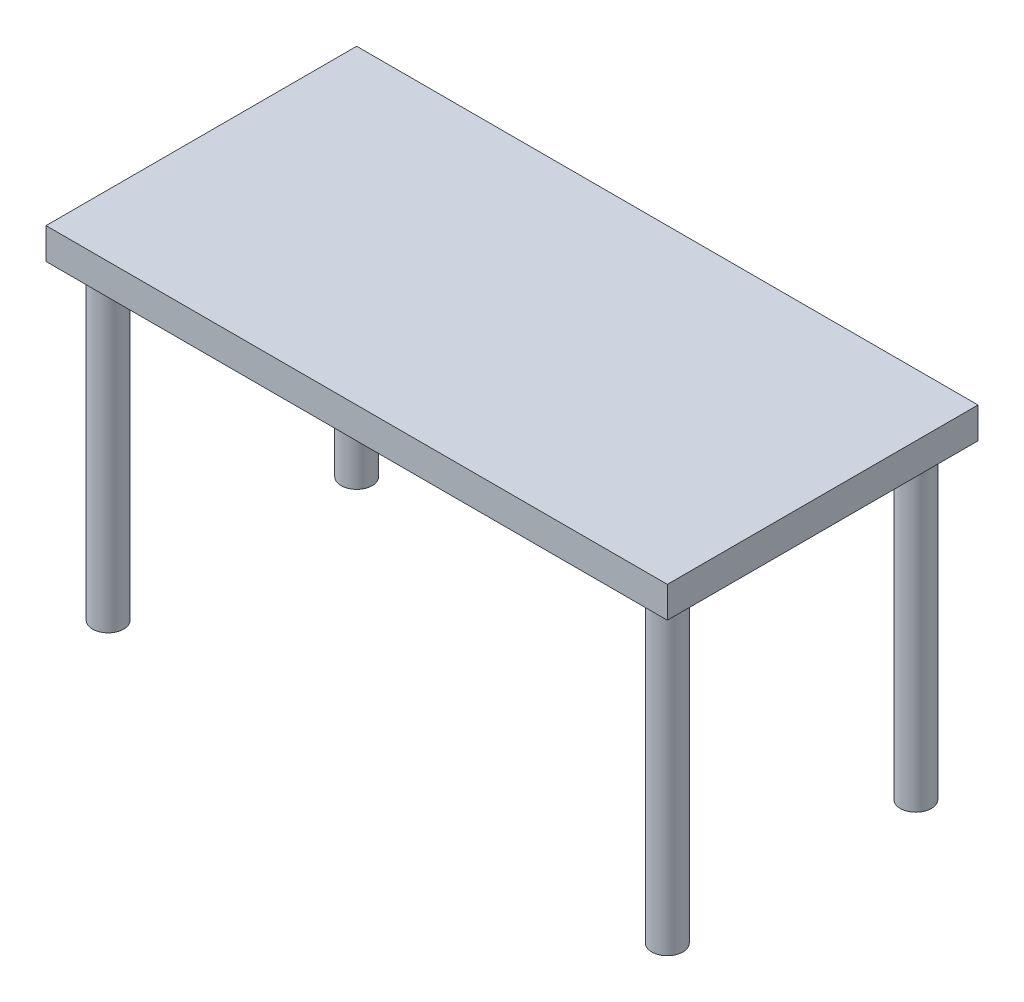
ISO-10303-21;
HEADER;
FILE_DESCRIPTION(('STEP AP214'),'2;1');
FILE_NAME('part.step','',(''),(''),'','','');
FILE_SCHEMA(('AUTOMOTIVE_DESIGN { 1 0 10303 214 1 1 1 1 }'));
ENDSEC;
DATA;
#1=APPLICATION_CONTEXT('core data for automotive mechanical design processes');
#2=APPLICATION_PROTOCOL_DEFINITION('international standard','automotive_design',2000,#1);
#3=PRODUCT_CONTEXT('',#1,'mechanical');
#4=PRODUCT('Part','Part','',(#3));
#5=PRODUCT_RELATED_PRODUCT_CATEGORY('part','',(#4));
#6=PRODUCT_DEFINITION_FORMATION('','',#4);
#7=PRODUCT_DEFINITION_CONTEXT('part definition',#1,'design');
#8=PRODUCT_DEFINITION('design','',#6,#7);
#9=PRODUCT_DEFINITION_SHAPE('','',#8);
#10=(LENGTH_UNIT() NAMED_UNIT(*) SI_UNIT(.MILLI.,.METRE.));
#11=(NAMED_UNIT(*) PLANE_ANGLE_UNIT() SI_UNIT($,.RADIAN.));
#12=(NAMED_UNIT(*) SI_UNIT($,.STERADIAN.) SOLID_ANGLE_UNIT());
#13=UNCERTAINTY_MEASURE_WITH_UNIT(LENGTH_MEASURE(1.E-05),#10,'distance_accuracy_value','');
#14=(GEOMETRIC_REPRESENTATION_CONTEXT(3) GLOBAL_UNCERTAINTY_ASSIGNED_CONTEXT((#13)) GLOBAL_UNIT_ASSIGNED_CONTEXT((#10,
#11,#12)) REPRESENTATION_CONTEXT('',''));
#15=CARTESIAN_POINT('',(0.,0.,0.));
#16=DIRECTION('',(0.,0.,1.));
#17=DIRECTION('',(1.,0.,0.));
#18=AXIS2_PLACEMENT_3D('',#15,#16,#17);
#19=CARTESIAN_POINT('',(0.,-100.,-500.));
#20=DIRECTION('',(0.,0.,-1.));
#21=DIRECTION('',(-1.,0.,0.));
#22=AXIS2_PLACEMENT_3D('',#19,#20,#21);
#23=PLANE('',#22);
#24=DIRECTION('',(-1.,0.,0.));
#25=VECTOR('',#24,1.);
#26=CARTESIAN_POINT('',(0.,0.,-500.));
#27=LINE('',#26,#25);
#28=CARTESIAN_POINT('',(1000.,0.,-500.));
#29=VERTEX_POINT('',#28);
#30=CARTESIAN_POINT('',(-1000.,0.,-500.));
#31=VERTEX_POINT('',#30);
#32=EDGE_CURVE('E122',#29,#31,#27,.T.);
#33=ORIENTED_EDGE('',*,*,#32,.F.);
#34=DIRECTION('',(0.,1.,0.));
#35=VECTOR('',#34,1.);
#36=CARTESIAN_POINT('',(1000.,-100.,-500.));
#37=LINE('',#36,#35);
#38=CARTESIAN_POINT('',(1000.,-100.,-500.));
#39=VERTEX_POINT('',#38);
#40=EDGE_CURVE('E48',#39,#29,#37,.T.);
#41=ORIENTED_EDGE('',*,*,#40,.F.);
#42=DIRECTION('',(-1.,0.,0.));
#43=VECTOR('',#42,1.);
#44=CARTESIAN_POINT('',(0.,-100.,-500.));
#45=LINE('',#44,#43);
#46=CARTESIAN_POINT('',(-1000.,-100.,-500.));
#47=VERTEX_POINT('',#46);
#48=EDGE_CURVE('E121',#39,#47,#45,.T.);
#49=ORIENTED_EDGE('',*,*,#48,.T.);
#50=DIRECTION('',(0.,1.,0.));
#51=VECTOR('',#50,1.);
#52=CARTESIAN_POINT('',(-1000.,-100.,-500.));
#53=LINE('',#52,#51);
#54=EDGE_CURVE('E78',#47,#31,#53,.T.);
#55=ORIENTED_EDGE('',*,*,#54,.T.);
#56=EDGE_LOOP('',(#33,#41,#49,#55));
#57=FACE_BOUND('',#56,.T.);
#58=ADVANCED_FACE('F33',(#57),#23,.T.);
#59=CARTESIAN_POINT('',(1000.,-100.,0.));
#60=DIRECTION('',(1.,0.,0.));
#61=DIRECTION('',(0.,0.,-1.));
#62=AXIS2_PLACEMENT_3D('',#59,#60,#61);
#63=PLANE('',#62);
#64=DIRECTION('',(0.,0.,-1.));
#65=VECTOR('',#64,1.);
#66=CARTESIAN_POINT('',(1000.,0.,0.));
#67=LINE('',#66,#65);
#68=CARTESIAN_POINT('',(1000.,0.,500.));
#69=VERTEX_POINT('',#68);
#70=EDGE_CURVE('E117',#69,#29,#67,.T.);
#71=ORIENTED_EDGE('',*,*,#70,.F.);
#72=DIRECTION('',(0.,1.,0.));
#73=VECTOR('',#72,1.);
#74=CARTESIAN_POINT('',(1000.,-100.,500.));
#75=LINE('',#74,#73);
#76=CARTESIAN_POINT('',(1000.,-100.,500.));
#77=VERTEX_POINT('',#76);
#78=EDGE_CURVE('E90',#77,#69,#75,.T.);
#79=ORIENTED_EDGE('',*,*,#78,.F.);
#80=DIRECTION('',(0.,0.,-1.));
#81=VECTOR('',#80,1.);
#82=CARTESIAN_POINT('',(1000.,-100.,0.));
#83=LINE('',#82,#81);
#84=EDGE_CURVE('E86',#77,#39,#83,.T.);
#85=ORIENTED_EDGE('',*,*,#84,.T.);
#86=ORIENTED_EDGE('',*,*,#40,.T.);
#87=EDGE_LOOP('',(#71,#79,#85,#86));
#88=FACE_BOUND('',#87,.T.);
#89=ADVANCED_FACE('F35',(#88),#63,.T.);
#90=CARTESIAN_POINT('',(0.,-100.,0.));
#91=DIRECTION('',(0.,-1.,0.));
#92=DIRECTION('',(0.,0.,-1.));
#93=AXIS2_PLACEMENT_3D('',#90,#91,#92);
#94=PLANE('',#93);
#95=CARTESIAN_POINT('',(-900.,-100.,400.));
#96=DIRECTION('',(0.,-1.,0.));
#97=DIRECTION('',(0.,0.,1.));
#98=AXIS2_PLACEMENT_3D('',#95,#96,#97);
#99=CIRCLE('',#98,50.);
#100=CARTESIAN_POINT('',(-900.,-100.,450.));
#101=VERTEX_POINT('',#100);
#102=EDGE_CURVE('E102',#101,#101,#99,.T.);
#103=ORIENTED_EDGE('',*,*,#102,.F.);
#104=EDGE_LOOP('',(#103));
#105=FACE_BOUND('',#104,.T.);
#106=CARTESIAN_POINT('',(900.,-100.,400.));
#107=DIRECTION('',(0.,-1.,0.));
#108=DIRECTION('',(0.,0.,-1.));
#109=AXIS2_PLACEMENT_3D('',#106,#107,#108);
#110=CIRCLE('',#109,50.);
#111=CARTESIAN_POINT('',(900.,-100.,350.));
#112=VERTEX_POINT('',#111);
#113=EDGE_CURVE('E11',#112,#112,#110,.T.);
#114=ORIENTED_EDGE('',*,*,#113,.F.);
#115=EDGE_LOOP('',(#114));
#116=FACE_BOUND('',#115,.T.);
#117=CARTESIAN_POINT('',(-900.,-100.,-400.));
#118=DIRECTION('',(0.,-1.,0.));
#119=DIRECTION('',(0.,0.,-1.));
#120=AXIS2_PLACEMENT_3D('',#117,#118,#119);
#121=CIRCLE('',#120,50.);
#122=CARTESIAN_POINT('',(-900.,-100.,-450.));
#123=VERTEX_POINT('',#122);
#124=EDGE_CURVE('E42',#123,#123,#121,.T.);
#125=ORIENTED_EDGE('',*,*,#124,.F.);
#126=EDGE_LOOP('',(#125));
#127=FACE_BOUND('',#126,.T.);
#128=CARTESIAN_POINT('',(900.,-100.,-400.));
#129=DIRECTION('',(0.,-1.,0.));
#130=DIRECTION('',(0.,0.,-1.));
#131=AXIS2_PLACEMENT_3D('',#128,#129,#130);
#132=CIRCLE('',#131,50.);
#133=CARTESIAN_POINT('',(900.,-100.,-450.));
#134=VERTEX_POINT('',#133);
#135=EDGE_CURVE('E113',#134,#134,#132,.T.);
#136=ORIENTED_EDGE('',*,*,#135,.F.);
#137=EDGE_LOOP('',(#136));
#138=FACE_BOUND('',#137,.T.);
#139=DIRECTION('',(-1.,0.,0.));
#140=VECTOR('',#139,1.);
#141=CARTESIAN_POINT('',(0.,-100.,500.));
#142=LINE('',#141,#140);
#143=CARTESIAN_POINT('',(-1000.,-100.,500.));
#144=VERTEX_POINT('',#143);
#145=EDGE_CURVE('E84',#77,#144,#142,.T.);
#146=ORIENTED_EDGE('',*,*,#145,.T.);
#147=DIRECTION('',(0.,0.,-1.));
#148=VECTOR('',#147,1.);
#149=CARTESIAN_POINT('',(-1000.,-100.,0.));
#150=LINE('',#149,#148);
#151=EDGE_CURVE('E71',#144,#47,#150,.T.);
#152=ORIENTED_EDGE('',*,*,#151,.T.);
#153=ORIENTED_EDGE('',*,*,#48,.F.);
#154=ORIENTED_EDGE('',*,*,#84,.F.);
#155=EDGE_LOOP('',(#146,#152,#153,#154));
#156=FACE_BOUND('',#155,.T.);
#157=ADVANCED_FACE('F85',(#105,#116,#127,#138,#156),#94,.T.);
#158=CARTESIAN_POINT('',(0.,0.,0.));
#159=DIRECTION('',(0.,-1.,0.));
#160=DIRECTION('',(0.,0.,-1.));
#161=AXIS2_PLACEMENT_3D('',#158,#159,#160);
#162=PLANE('',#161);
#163=ORIENTED_EDGE('',*,*,#32,.T.);
#164=DIRECTION('',(0.,0.,-1.));
#165=VECTOR('',#164,1.);
#166=CARTESIAN_POINT('',(-1000.,0.,0.));
#167=LINE('',#166,#165);
#168=CARTESIAN_POINT('',(-1000.,0.,500.));
#169=VERTEX_POINT('',#168);
#170=EDGE_CURVE('E81',#169,#31,#167,.T.);
#171=ORIENTED_EDGE('',*,*,#170,.F.);
#172=DIRECTION('',(-1.,0.,0.));
#173=VECTOR('',#172,1.);
#174=CARTESIAN_POINT('',(0.,0.,500.));
#175=LINE('',#174,#173);
#176=EDGE_CURVE('E91',#69,#169,#175,.T.);
#177=ORIENTED_EDGE('',*,*,#176,.F.);
#178=ORIENTED_EDGE('',*,*,#70,.T.);
#179=EDGE_LOOP('',(#163,#171,#177,#178));
#180=FACE_BOUND('',#179,.T.);
#181=ADVANCED_FACE('F134',(#180),#162,.F.);
#182=CARTESIAN_POINT('',(900.,-1100.,-400.));
#183=DIRECTION('',(0.,1.,0.));
#184=DIRECTION('',(0.,0.,1.));
#185=AXIS2_PLACEMENT_3D('',#182,#183,#184);
#186=CYLINDRICAL_SURFACE('',#185,50.);
#187=CARTESIAN_POINT('',(900.,-1100.,-400.));
#188=DIRECTION('',(0.,-1.,0.));
#189=DIRECTION('',(0.,0.,-1.));
#190=AXIS2_PLACEMENT_3D('',#187,#188,#189);
#191=CIRCLE('',#190,50.);
#192=CARTESIAN_POINT('',(900.,-1100.,-450.));
#193=VERTEX_POINT('',#192);
#194=EDGE_CURVE('E114',#193,#193,#191,.T.);
#195=ORIENTED_EDGE('',*,*,#194,.F.);
#196=EDGE_LOOP('',(#195));
#197=FACE_BOUND('',#196,.T.);
#198=ORIENTED_EDGE('',*,*,#135,.T.);
#199=EDGE_LOOP('',(#198));
#200=FACE_BOUND('',#199,.T.);
#201=ADVANCED_FACE('F139',(#197,#200),#186,.T.);
#202=CARTESIAN_POINT('',(900.,-1100.,-400.));
#203=DIRECTION('',(0.,-1.,0.));
#204=DIRECTION('',(0.,0.,-1.));
#205=AXIS2_PLACEMENT_3D('',#202,#203,#204);
#206=PLANE('',#205);
#207=ORIENTED_EDGE('',*,*,#194,.T.);
#208=EDGE_LOOP('',(#207));
#209=FACE_BOUND('',#208,.T.);
#210=ADVANCED_FACE('F141',(#209),#206,.T.);
#211=CARTESIAN_POINT('',(-1000.,-100.,0.));
#212=DIRECTION('',(1.,0.,0.));
#213=DIRECTION('',(0.,0.,-1.));
#214=AXIS2_PLACEMENT_3D('',#211,#212,#213);
#215=PLANE('',#214);
#216=ORIENTED_EDGE('',*,*,#170,.T.);
#217=ORIENTED_EDGE('',*,*,#54,.F.);
#218=ORIENTED_EDGE('',*,*,#151,.F.);
#219=DIRECTION('',(0.,1.,0.));
#220=VECTOR('',#219,1.);
#221=CARTESIAN_POINT('',(-1000.,-100.,500.));
#222=LINE('',#221,#220);
#223=EDGE_CURVE('E76',#144,#169,#222,.T.);
#224=ORIENTED_EDGE('',*,*,#223,.T.);
#225=EDGE_LOOP('',(#216,#217,#218,#224));
#226=FACE_BOUND('',#225,.T.);
#227=ADVANCED_FACE('F74',(#226),#215,.F.);
#228=CARTESIAN_POINT('',(-900.,-1100.,-400.));
#229=DIRECTION('',(0.,1.,0.));
#230=DIRECTION('',(0.,0.,1.));
#231=AXIS2_PLACEMENT_3D('',#228,#229,#230);
#232=CYLINDRICAL_SURFACE('',#231,50.);
#233=CARTESIAN_POINT('',(-900.,-1100.,-400.));
#234=DIRECTION('',(0.,1.,0.));
#235=DIRECTION('',(0.,0.,-1.));
#236=AXIS2_PLACEMENT_3D('',#233,#234,#235);
#237=CIRCLE('',#236,50.);
#238=CARTESIAN_POINT('',(-900.,-1100.,-450.));
#239=VERTEX_POINT('',#238);
#240=EDGE_CURVE('E108',#239,#239,#237,.T.);
#241=ORIENTED_EDGE('',*,*,#240,.T.);
#242=EDGE_LOOP('',(#241));
#243=FACE_BOUND('',#242,.T.);
#244=ORIENTED_EDGE('',*,*,#124,.T.);
#245=EDGE_LOOP('',(#244));
#246=FACE_BOUND('',#245,.T.);
#247=ADVANCED_FACE('F130',(#243,#246),#232,.T.);
#248=CARTESIAN_POINT('',(-900.,-1100.,-400.));
#249=DIRECTION('',(0.,-1.,0.));
#250=DIRECTION('',(0.,0.,-1.));
#251=AXIS2_PLACEMENT_3D('',#248,#249,#250);
#252=PLANE('',#251);
#253=ORIENTED_EDGE('',*,*,#240,.F.);
#254=EDGE_LOOP('',(#253));
#255=FACE_BOUND('',#254,.T.);
#256=ADVANCED_FACE('F190',(#255),#252,.T.);
#257=CARTESIAN_POINT('',(0.,-100.,500.));
#258=DIRECTION('',(0.,0.,-1.));
#259=DIRECTION('',(-1.,0.,0.));
#260=AXIS2_PLACEMENT_3D('',#257,#258,#259);
#261=PLANE('',#260);
#262=ORIENTED_EDGE('',*,*,#176,.T.);
#263=ORIENTED_EDGE('',*,*,#223,.F.);
#264=ORIENTED_EDGE('',*,*,#145,.F.);
#265=ORIENTED_EDGE('',*,*,#78,.T.);
#266=EDGE_LOOP('',(#262,#263,#264,#265));
#267=FACE_BOUND('',#266,.T.);
#268=ADVANCED_FACE('F94',(#267),#261,.F.);
#269=CARTESIAN_POINT('',(900.,-1100.,400.));
#270=DIRECTION('',(0.,1.,0.));
#271=DIRECTION('',(0.,0.,1.));
#272=AXIS2_PLACEMENT_3D('',#269,#270,#271);
#273=CYLINDRICAL_SURFACE('',#272,50.);
#274=CARTESIAN_POINT('',(900.,-1100.,400.));
#275=DIRECTION('',(0.,1.,0.));
#276=DIRECTION('',(0.,0.,1.));
#277=AXIS2_PLACEMENT_3D('',#274,#275,#276);
#278=CIRCLE('',#277,50.);
#279=CARTESIAN_POINT('',(900.,-1100.,450.));
#280=VERTEX_POINT('',#279);
#281=EDGE_CURVE('E96',#280,#280,#278,.T.);
#282=ORIENTED_EDGE('',*,*,#281,.T.);
#283=EDGE_LOOP('',(#282));
#284=FACE_BOUND('',#283,.T.);
#285=ORIENTED_EDGE('',*,*,#113,.T.);
#286=EDGE_LOOP('',(#285));
#287=FACE_BOUND('',#286,.T.);
#288=ADVANCED_FACE('F189',(#284,#287),#273,.T.);
#289=CARTESIAN_POINT('',(900.,-1100.,400.));
#290=DIRECTION('',(0.,-1.,0.));
#291=DIRECTION('',(0.,0.,1.));
#292=AXIS2_PLACEMENT_3D('',#289,#290,#291);
#293=PLANE('',#292);
#294=ORIENTED_EDGE('',*,*,#281,.F.);
#295=EDGE_LOOP('',(#294));
#296=FACE_BOUND('',#295,.T.);
#297=ADVANCED_FACE('F202',(#296),#293,.T.);
#298=CARTESIAN_POINT('',(-900.,-1100.,400.));
#299=DIRECTION('',(0.,1.,0.));
#300=DIRECTION('',(0.,0.,1.));
#301=AXIS2_PLACEMENT_3D('',#298,#299,#300);
#302=CYLINDRICAL_SURFACE('',#301,50.);
#303=CARTESIAN_POINT('',(-900.,-1100.,400.));
#304=DIRECTION('',(0.,-1.,0.));
#305=DIRECTION('',(0.,0.,1.));
#306=AXIS2_PLACEMENT_3D('',#303,#304,#305);
#307=CIRCLE('',#306,50.);
#308=CARTESIAN_POINT('',(-900.,-1100.,450.));
#309=VERTEX_POINT('',#308);
#310=EDGE_CURVE('E97',#309,#309,#307,.T.);
#311=ORIENTED_EDGE('',*,*,#310,.F.);
#312=EDGE_LOOP('',(#311));
#313=FACE_BOUND('',#312,.T.);
#314=ORIENTED_EDGE('',*,*,#102,.T.);
#315=EDGE_LOOP('',(#314));
#316=FACE_BOUND('',#315,.T.);
#317=ADVANCED_FACE('F212',(#313,#316),#302,.T.);
#318=CARTESIAN_POINT('',(-900.,-1100.,400.));
#319=DIRECTION('',(0.,-1.,0.));
#320=DIRECTION('',(0.,0.,1.));
#321=AXIS2_PLACEMENT_3D('',#318,#319,#320);
#322=PLANE('',#321);
#323=ORIENTED_EDGE('',*,*,#310,.T.);
#324=EDGE_LOOP('',(#323));
#325=FACE_BOUND('',#324,.T.);
#326=ADVANCED_FACE('F221',(#325),#322,.T.);
#327=CLOSED_SHELL('',(#58,#89,#157,#181,#201,#210,#227,#247,#256,#268,#288,#297,#317,#326));
#328=MANIFOLD_SOLID_BREP('B2',#327);
#329=ADVANCED_BREP_SHAPE_REPRESENTATION('',(#18,#328),#14);
#330=SHAPE_DEFINITION_REPRESENTATION(#9,#329);
ENDSEC;
END-ISO-10303-21;
